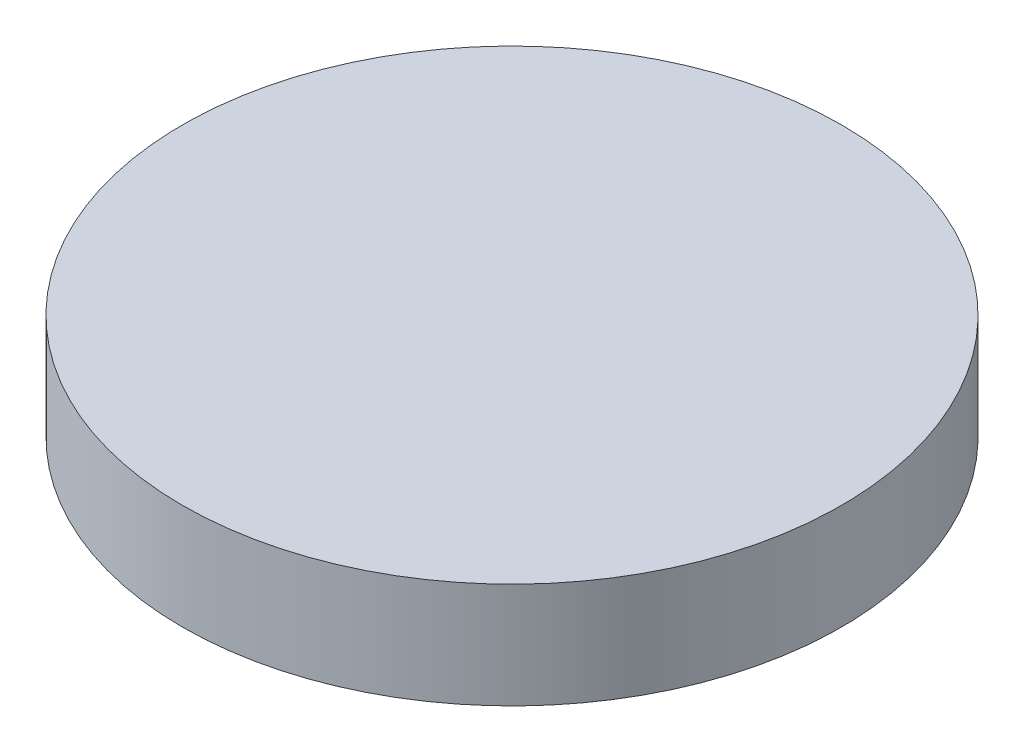
ISO-10303-21;
HEADER;
FILE_DESCRIPTION(('STEP AP214'),'2;1');
FILE_NAME('part.step','',(''),(''),'','','');
FILE_SCHEMA(('AUTOMOTIVE_DESIGN { 1 0 10303 214 1 1 1 1 }'));
ENDSEC;
DATA;
#1=APPLICATION_CONTEXT('core data for automotive mechanical design processes');
#2=APPLICATION_PROTOCOL_DEFINITION('international standard','automotive_design',2000,#1);
#3=PRODUCT_CONTEXT('',#1,'mechanical');
#4=PRODUCT('Part','Part','',(#3));
#5=PRODUCT_RELATED_PRODUCT_CATEGORY('part','',(#4));
#6=PRODUCT_DEFINITION_FORMATION('','',#4);
#7=PRODUCT_DEFINITION_CONTEXT('part definition',#1,'design');
#8=PRODUCT_DEFINITION('design','',#6,#7);
#9=PRODUCT_DEFINITION_SHAPE('','',#8);
#10=(LENGTH_UNIT() NAMED_UNIT(*) SI_UNIT(.MILLI.,.METRE.));
#11=(NAMED_UNIT(*) PLANE_ANGLE_UNIT() SI_UNIT($,.RADIAN.));
#12=(NAMED_UNIT(*) SI_UNIT($,.STERADIAN.) SOLID_ANGLE_UNIT());
#13=UNCERTAINTY_MEASURE_WITH_UNIT(LENGTH_MEASURE(1.E-05),#10,'distance_accuracy_value','');
#14=(GEOMETRIC_REPRESENTATION_CONTEXT(3) GLOBAL_UNCERTAINTY_ASSIGNED_CONTEXT((#13)) GLOBAL_UNIT_ASSIGNED_CONTEXT((#10,
#11,#12)) REPRESENTATION_CONTEXT('',''));
#15=CARTESIAN_POINT('',(0.,0.,0.));
#16=DIRECTION('',(0.,0.,1.));
#17=DIRECTION('',(1.,0.,0.));
#18=AXIS2_PLACEMENT_3D('',#15,#16,#17);
#19=CARTESIAN_POINT('',(0.,3.2,0.));
#20=DIRECTION('',(0.,-1.,0.));
#21=DIRECTION('',(0.,0.,-1.));
#22=AXIS2_PLACEMENT_3D('',#19,#20,#21);
#23=CYLINDRICAL_SURFACE('',#22,10.);
#24=CARTESIAN_POINT('',(0.,3.2,0.));
#25=DIRECTION('',(0.,1.,0.));
#26=DIRECTION('',(0.,0.,1.));
#27=AXIS2_PLACEMENT_3D('',#24,#25,#26);
#28=CIRCLE('',#27,10.);
#29=CARTESIAN_POINT('',(0.,3.2,10.));
#30=VERTEX_POINT('',#29);
#31=EDGE_CURVE('E10',#30,#30,#28,.T.);
#32=ORIENTED_EDGE('',*,*,#31,.F.);
#33=EDGE_LOOP('',(#32));
#34=FACE_BOUND('',#33,.T.);
#35=CARTESIAN_POINT('',(0.,0.,0.));
#36=DIRECTION('',(0.,1.,0.));
#37=DIRECTION('',(0.,0.,1.));
#38=AXIS2_PLACEMENT_3D('',#35,#36,#37);
#39=CIRCLE('',#38,10.);
#40=CARTESIAN_POINT('',(0.,0.,10.));
#41=VERTEX_POINT('',#40);
#42=EDGE_CURVE('E35',#41,#41,#39,.T.);
#43=ORIENTED_EDGE('',*,*,#42,.T.);
#44=EDGE_LOOP('',(#43));
#45=FACE_BOUND('',#44,.T.);
#46=ADVANCED_FACE('F32',(#34,#45),#23,.T.);
#47=CARTESIAN_POINT('',(0.,3.2,0.));
#48=DIRECTION('',(0.,1.,0.));
#49=DIRECTION('',(0.,0.,1.));
#50=AXIS2_PLACEMENT_3D('',#47,#48,#49);
#51=PLANE('',#50);
#52=ORIENTED_EDGE('',*,*,#31,.T.);
#53=EDGE_LOOP('',(#52));
#54=FACE_BOUND('',#53,.T.);
#55=ADVANCED_FACE('F47',(#54),#51,.T.);
#56=CARTESIAN_POINT('',(0.,0.,0.));
#57=DIRECTION('',(0.,1.,0.));
#58=DIRECTION('',(0.,0.,1.));
#59=AXIS2_PLACEMENT_3D('',#56,#57,#58);
#60=PLANE('',#59);
#61=ORIENTED_EDGE('',*,*,#42,.F.);
#62=EDGE_LOOP('',(#61));
#63=FACE_BOUND('',#62,.T.);
#64=ADVANCED_FACE('F45',(#63),#60,.F.);
#65=CLOSED_SHELL('',(#46,#55,#64));
#66=MANIFOLD_SOLID_BREP('B2',#65);
#67=ADVANCED_BREP_SHAPE_REPRESENTATION('',(#18,#66),#14);
#68=SHAPE_DEFINITION_REPRESENTATION(#9,#67);
ENDSEC;
END-ISO-10303-21;
